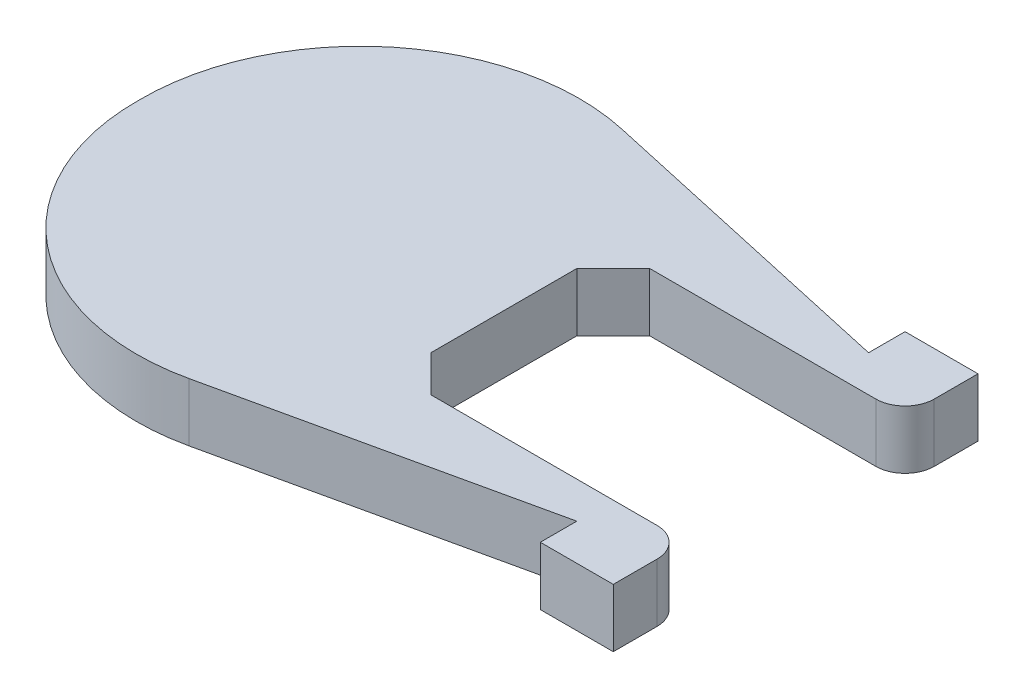
ISO-10303-21;
HEADER;
FILE_DESCRIPTION(('STEP AP214'),'2;1');
FILE_NAME('part.step','',(''),(''),'','','');
FILE_SCHEMA(('AUTOMOTIVE_DESIGN { 1 0 10303 214 1 1 1 1 }'));
ENDSEC;
DATA;
#1=APPLICATION_CONTEXT('core data for automotive mechanical design processes');
#2=APPLICATION_PROTOCOL_DEFINITION('international standard','automotive_design',2000,#1);
#3=PRODUCT_CONTEXT('',#1,'mechanical');
#4=PRODUCT('Part','Part','',(#3));
#5=PRODUCT_RELATED_PRODUCT_CATEGORY('part','',(#4));
#6=PRODUCT_DEFINITION_FORMATION('','',#4);
#7=PRODUCT_DEFINITION_CONTEXT('part definition',#1,'design');
#8=PRODUCT_DEFINITION('design','',#6,#7);
#9=PRODUCT_DEFINITION_SHAPE('','',#8);
#10=(LENGTH_UNIT() NAMED_UNIT(*) SI_UNIT(.MILLI.,.METRE.));
#11=(NAMED_UNIT(*) PLANE_ANGLE_UNIT() SI_UNIT($,.RADIAN.));
#12=(NAMED_UNIT(*) SI_UNIT($,.STERADIAN.) SOLID_ANGLE_UNIT());
#13=UNCERTAINTY_MEASURE_WITH_UNIT(LENGTH_MEASURE(1.E-05),#10,'distance_accuracy_value','');
#14=(GEOMETRIC_REPRESENTATION_CONTEXT(3) GLOBAL_UNCERTAINTY_ASSIGNED_CONTEXT((#13)) GLOBAL_UNIT_ASSIGNED_CONTEXT((#10,
#11,#12)) REPRESENTATION_CONTEXT('',''));
#15=CARTESIAN_POINT('',(0.,0.,0.));
#16=DIRECTION('',(0.,0.,1.));
#17=DIRECTION('',(1.,0.,0.));
#18=AXIS2_PLACEMENT_3D('',#15,#16,#17);
#19=CARTESIAN_POINT('',(40.,8.,-25.));
#20=DIRECTION('',(0.,0.,1.));
#21=DIRECTION('',(1.,0.,0.));
#22=AXIS2_PLACEMENT_3D('',#19,#20,#21);
#23=PLANE('',#22);
#24=DIRECTION('',(-1.,0.,0.));
#25=VECTOR('',#24,1.);
#26=CARTESIAN_POINT('',(40.,0.,-25.));
#27=LINE('',#26,#25);
#28=CARTESIAN_POINT('',(40.,0.,-25.));
#29=VERTEX_POINT('',#28);
#30=CARTESIAN_POINT('',(30.,0.,-25.));
#31=VERTEX_POINT('',#30);
#32=EDGE_CURVE('E185',#29,#31,#27,.T.);
#33=ORIENTED_EDGE('',*,*,#32,.T.);
#34=DIRECTION('',(0.,-1.,0.));
#35=VECTOR('',#34,1.);
#36=CARTESIAN_POINT('',(30.,8.,-25.));
#37=LINE('',#36,#35);
#38=CARTESIAN_POINT('',(30.,8.,-25.));
#39=VERTEX_POINT('',#38);
#40=EDGE_CURVE('E11',#39,#31,#37,.T.);
#41=ORIENTED_EDGE('',*,*,#40,.F.);
#42=DIRECTION('',(-1.,0.,0.));
#43=VECTOR('',#42,1.);
#44=CARTESIAN_POINT('',(40.,8.,-25.));
#45=LINE('',#44,#43);
#46=CARTESIAN_POINT('',(40.,8.,-25.));
#47=VERTEX_POINT('',#46);
#48=EDGE_CURVE('E217',#47,#39,#45,.T.);
#49=ORIENTED_EDGE('',*,*,#48,.F.);
#50=DIRECTION('',(0.,-1.,0.));
#51=VECTOR('',#50,1.);
#52=CARTESIAN_POINT('',(40.,8.,-25.));
#53=LINE('',#52,#51);
#54=EDGE_CURVE('E181',#47,#29,#53,.T.);
#55=ORIENTED_EDGE('',*,*,#54,.T.);
#56=EDGE_LOOP('',(#33,#41,#49,#55));
#57=FACE_BOUND('',#56,.T.);
#58=ADVANCED_FACE('F35',(#57),#23,.F.);
#59=CARTESIAN_POINT('',(30.,8.,-25.));
#60=DIRECTION('',(1.,0.,0.));
#61=DIRECTION('',(0.,0.,-1.));
#62=AXIS2_PLACEMENT_3D('',#59,#60,#61);
#63=PLANE('',#62);
#64=DIRECTION('',(0.,0.,1.));
#65=VECTOR('',#64,1.);
#66=CARTESIAN_POINT('',(30.,0.,-25.));
#67=LINE('',#66,#65);
#68=CARTESIAN_POINT('',(30.,0.,-20.));
#69=VERTEX_POINT('',#68);
#70=EDGE_CURVE('E188',#31,#69,#67,.T.);
#71=ORIENTED_EDGE('',*,*,#70,.T.);
#72=DIRECTION('',(0.,-1.,0.));
#73=VECTOR('',#72,1.);
#74=CARTESIAN_POINT('',(30.,8.,-20.));
#75=LINE('',#74,#73);
#76=CARTESIAN_POINT('',(30.,8.,-20.));
#77=VERTEX_POINT('',#76);
#78=EDGE_CURVE('E43',#77,#69,#75,.T.);
#79=ORIENTED_EDGE('',*,*,#78,.F.);
#80=DIRECTION('',(0.,0.,1.));
#81=VECTOR('',#80,1.);
#82=CARTESIAN_POINT('',(30.,8.,-25.));
#83=LINE('',#82,#81);
#84=EDGE_CURVE('E121',#39,#77,#83,.T.);
#85=ORIENTED_EDGE('',*,*,#84,.F.);
#86=ORIENTED_EDGE('',*,*,#40,.T.);
#87=EDGE_LOOP('',(#71,#79,#85,#86));
#88=FACE_BOUND('',#87,.T.);
#89=ADVANCED_FACE('F320',(#88),#63,.F.);
#90=CARTESIAN_POINT('',(30.,8.,-20.));
#91=DIRECTION('',(-0.216439613938103,0.,0.976296007119933));
#92=DIRECTION('',(0.976296007119933,0.,0.216439613938103));
#93=AXIS2_PLACEMENT_3D('',#90,#91,#92);
#94=PLANE('',#93);
#95=DIRECTION('',(-0.976296007119933,0.,-0.216439613938103));
#96=VECTOR('',#95,1.);
#97=CARTESIAN_POINT('',(30.,0.,-20.));
#98=LINE('',#97,#96);
#99=CARTESIAN_POINT('',(-13.5068115818569,0.,-29.6452279163097));
#100=VERTEX_POINT('',#99);
#101=EDGE_CURVE('E190',#69,#100,#98,.T.);
#102=ORIENTED_EDGE('',*,*,#101,.T.);
#103=DIRECTION('',(0.,-1.,0.));
#104=VECTOR('',#103,1.);
#105=CARTESIAN_POINT('',(-13.5068115818569,8.,-29.6452279163097));
#106=LINE('',#105,#104);
#107=CARTESIAN_POINT('',(-13.5068115818569,8.,-29.6452279163097));
#108=VERTEX_POINT('',#107);
#109=EDGE_CURVE('E251',#108,#100,#106,.T.);
#110=ORIENTED_EDGE('',*,*,#109,.F.);
#111=DIRECTION('',(-0.976296007119933,0.,-0.216439613938103));
#112=VECTOR('',#111,1.);
#113=CARTESIAN_POINT('',(30.,8.,-20.));
#114=LINE('',#113,#112);
#115=EDGE_CURVE('E259',#77,#108,#114,.T.);
#116=ORIENTED_EDGE('',*,*,#115,.F.);
#117=ORIENTED_EDGE('',*,*,#78,.T.);
#118=EDGE_LOOP('',(#102,#110,#116,#117));
#119=FACE_BOUND('',#118,.T.);
#120=ADVANCED_FACE('F257',(#119),#94,.F.);
#121=CARTESIAN_POINT('',(-20.,8.,-0.356347702711738));
#122=DIRECTION('',(0.,-1.,0.));
#123=DIRECTION('',(0.,0.,-1.));
#124=AXIS2_PLACEMENT_3D('',#121,#122,#123);
#125=CYLINDRICAL_SURFACE('',#124,30.);
#126=CARTESIAN_POINT('',(-20.,0.,-0.356347702711738));
#127=DIRECTION('',(0.,1.,0.));
#128=DIRECTION('',(0.,0.,1.));
#129=AXIS2_PLACEMENT_3D('',#126,#127,#128);
#130=CIRCLE('',#129,30.);
#131=CARTESIAN_POINT('',(-49.9978835305888,0.,0.));
#132=VERTEX_POINT('',#131);
#133=EDGE_CURVE('E192',#100,#132,#130,.T.);
#134=ORIENTED_EDGE('',*,*,#133,.T.);
#135=DIRECTION('',(0.,-1.,0.));
#136=VECTOR('',#135,1.);
#137=CARTESIAN_POINT('',(-49.9978835305888,8.,0.));
#138=LINE('',#137,#136);
#139=CARTESIAN_POINT('',(-49.9978835305888,8.,0.));
#140=VERTEX_POINT('',#139);
#141=EDGE_CURVE('E248',#140,#132,#138,.T.);
#142=ORIENTED_EDGE('',*,*,#141,.F.);
#143=CARTESIAN_POINT('',(-20.,8.,-0.356347702711738));
#144=DIRECTION('',(0.,1.,0.));
#145=DIRECTION('',(0.,0.,1.));
#146=AXIS2_PLACEMENT_3D('',#143,#144,#145);
#147=CIRCLE('',#146,30.);
#148=EDGE_CURVE('E277',#108,#140,#147,.T.);
#149=ORIENTED_EDGE('',*,*,#148,.F.);
#150=ORIENTED_EDGE('',*,*,#109,.T.);
#151=EDGE_LOOP('',(#134,#142,#149,#150));
#152=FACE_BOUND('',#151,.T.);
#153=ADVANCED_FACE('F268',(#152),#125,.T.);
#154=CARTESIAN_POINT('',(-20.,8.,0.356347702711738));
#155=DIRECTION('',(0.,-1.,0.));
#156=DIRECTION('',(0.,0.,-1.));
#157=AXIS2_PLACEMENT_3D('',#154,#155,#156);
#158=CYLINDRICAL_SURFACE('',#157,30.);
#159=CARTESIAN_POINT('',(-20.,0.,0.356347702711738));
#160=DIRECTION('',(0.,1.,0.));
#161=DIRECTION('',(0.,0.,-1.));
#162=AXIS2_PLACEMENT_3D('',#159,#160,#161);
#163=CIRCLE('',#162,30.);
#164=CARTESIAN_POINT('',(-13.5068115818569,0.,29.6452279163097));
#165=VERTEX_POINT('',#164);
#166=EDGE_CURVE('E194',#132,#165,#163,.T.);
#167=ORIENTED_EDGE('',*,*,#166,.T.);
#168=DIRECTION('',(0.,-1.,0.));
#169=VECTOR('',#168,1.);
#170=CARTESIAN_POINT('',(-13.5068115818569,8.,29.6452279163097));
#171=LINE('',#170,#169);
#172=CARTESIAN_POINT('',(-13.5068115818569,8.,29.6452279163097));
#173=VERTEX_POINT('',#172);
#174=EDGE_CURVE('E245',#173,#165,#171,.T.);
#175=ORIENTED_EDGE('',*,*,#174,.F.);
#176=CARTESIAN_POINT('',(-20.,8.,0.356347702711738));
#177=DIRECTION('',(0.,1.,0.));
#178=DIRECTION('',(0.,0.,-1.));
#179=AXIS2_PLACEMENT_3D('',#176,#177,#178);
#180=CIRCLE('',#179,30.);
#181=EDGE_CURVE('E274',#140,#173,#180,.T.);
#182=ORIENTED_EDGE('',*,*,#181,.F.);
#183=ORIENTED_EDGE('',*,*,#141,.T.);
#184=EDGE_LOOP('',(#167,#175,#182,#183));
#185=FACE_BOUND('',#184,.T.);
#186=ADVANCED_FACE('F272',(#185),#158,.T.);
#187=CARTESIAN_POINT('',(30.,8.,20.));
#188=DIRECTION('',(-0.216439613938103,0.,-0.976296007119933));
#189=DIRECTION('',(-0.976296007119933,0.,0.216439613938103));
#190=AXIS2_PLACEMENT_3D('',#187,#188,#189);
#191=PLANE('',#190);
#192=DIRECTION('',(0.976296007119933,0.,-0.216439613938103));
#193=VECTOR('',#192,1.);
#194=CARTESIAN_POINT('',(30.,0.,20.));
#195=LINE('',#194,#193);
#196=CARTESIAN_POINT('',(30.,0.,20.));
#197=VERTEX_POINT('',#196);
#198=EDGE_CURVE('E196',#165,#197,#195,.T.);
#199=ORIENTED_EDGE('',*,*,#198,.T.);
#200=DIRECTION('',(0.,-1.,0.));
#201=VECTOR('',#200,1.);
#202=CARTESIAN_POINT('',(30.,8.,20.));
#203=LINE('',#202,#201);
#204=CARTESIAN_POINT('',(30.,8.,20.));
#205=VERTEX_POINT('',#204);
#206=EDGE_CURVE('E242',#205,#197,#203,.T.);
#207=ORIENTED_EDGE('',*,*,#206,.F.);
#208=DIRECTION('',(0.976296007119933,0.,-0.216439613938103));
#209=VECTOR('',#208,1.);
#210=CARTESIAN_POINT('',(30.,8.,20.));
#211=LINE('',#210,#209);
#212=EDGE_CURVE('E276',#173,#205,#211,.T.);
#213=ORIENTED_EDGE('',*,*,#212,.F.);
#214=ORIENTED_EDGE('',*,*,#174,.T.);
#215=EDGE_LOOP('',(#199,#207,#213,#214));
#216=FACE_BOUND('',#215,.T.);
#217=ADVANCED_FACE('F333',(#216),#191,.F.);
#218=CARTESIAN_POINT('',(30.,8.,25.));
#219=DIRECTION('',(1.,0.,0.));
#220=DIRECTION('',(0.,0.,-1.));
#221=AXIS2_PLACEMENT_3D('',#218,#219,#220);
#222=PLANE('',#221);
#223=DIRECTION('',(0.,0.,1.));
#224=VECTOR('',#223,1.);
#225=CARTESIAN_POINT('',(30.,0.,25.));
#226=LINE('',#225,#224);
#227=CARTESIAN_POINT('',(30.,0.,25.));
#228=VERTEX_POINT('',#227);
#229=EDGE_CURVE('E198',#197,#228,#226,.T.);
#230=ORIENTED_EDGE('',*,*,#229,.T.);
#231=DIRECTION('',(0.,-1.,0.));
#232=VECTOR('',#231,1.);
#233=CARTESIAN_POINT('',(30.,8.,25.));
#234=LINE('',#233,#232);
#235=CARTESIAN_POINT('',(30.,8.,25.));
#236=VERTEX_POINT('',#235);
#237=EDGE_CURVE('E239',#236,#228,#234,.T.);
#238=ORIENTED_EDGE('',*,*,#237,.F.);
#239=DIRECTION('',(0.,0.,1.));
#240=VECTOR('',#239,1.);
#241=CARTESIAN_POINT('',(30.,8.,25.));
#242=LINE('',#241,#240);
#243=EDGE_CURVE('E279',#205,#236,#242,.T.);
#244=ORIENTED_EDGE('',*,*,#243,.F.);
#245=ORIENTED_EDGE('',*,*,#206,.T.);
#246=EDGE_LOOP('',(#230,#238,#244,#245));
#247=FACE_BOUND('',#246,.T.);
#248=ADVANCED_FACE('F336',(#247),#222,.F.);
#249=CARTESIAN_POINT('',(40.,8.,25.));
#250=DIRECTION('',(0.,0.,-1.));
#251=DIRECTION('',(-1.,0.,0.));
#252=AXIS2_PLACEMENT_3D('',#249,#250,#251);
#253=PLANE('',#252);
#254=DIRECTION('',(1.,0.,0.));
#255=VECTOR('',#254,1.);
#256=CARTESIAN_POINT('',(40.,0.,25.));
#257=LINE('',#256,#255);
#258=CARTESIAN_POINT('',(40.,0.,25.));
#259=VERTEX_POINT('',#258);
#260=EDGE_CURVE('E200',#228,#259,#257,.T.);
#261=ORIENTED_EDGE('',*,*,#260,.T.);
#262=DIRECTION('',(0.,-1.,0.));
#263=VECTOR('',#262,1.);
#264=CARTESIAN_POINT('',(40.,8.,25.));
#265=LINE('',#264,#263);
#266=CARTESIAN_POINT('',(40.,8.,25.));
#267=VERTEX_POINT('',#266);
#268=EDGE_CURVE('E236',#267,#259,#265,.T.);
#269=ORIENTED_EDGE('',*,*,#268,.F.);
#270=DIRECTION('',(1.,0.,0.));
#271=VECTOR('',#270,1.);
#272=CARTESIAN_POINT('',(40.,8.,25.));
#273=LINE('',#272,#271);
#274=EDGE_CURVE('E285',#236,#267,#273,.T.);
#275=ORIENTED_EDGE('',*,*,#274,.F.);
#276=ORIENTED_EDGE('',*,*,#237,.T.);
#277=EDGE_LOOP('',(#261,#269,#275,#276));
#278=FACE_BOUND('',#277,.T.);
#279=ADVANCED_FACE('F340',(#278),#253,.F.);
#280=CARTESIAN_POINT('',(40.,8.,19.));
#281=DIRECTION('',(-1.,0.,0.));
#282=DIRECTION('',(0.,0.,1.));
#283=AXIS2_PLACEMENT_3D('',#280,#281,#282);
#284=PLANE('',#283);
#285=DIRECTION('',(0.,0.,-1.));
#286=VECTOR('',#285,1.);
#287=CARTESIAN_POINT('',(40.,0.,19.));
#288=LINE('',#287,#286);
#289=CARTESIAN_POINT('',(40.,0.,19.));
#290=VERTEX_POINT('',#289);
#291=EDGE_CURVE('E202',#259,#290,#288,.T.);
#292=ORIENTED_EDGE('',*,*,#291,.T.);
#293=DIRECTION('',(0.,-1.,0.));
#294=VECTOR('',#293,1.);
#295=CARTESIAN_POINT('',(40.,8.,19.));
#296=LINE('',#295,#294);
#297=CARTESIAN_POINT('',(40.,8.,19.));
#298=VERTEX_POINT('',#297);
#299=EDGE_CURVE('E233',#298,#290,#296,.T.);
#300=ORIENTED_EDGE('',*,*,#299,.F.);
#301=DIRECTION('',(0.,0.,-1.));
#302=VECTOR('',#301,1.);
#303=CARTESIAN_POINT('',(40.,8.,19.));
#304=LINE('',#303,#302);
#305=EDGE_CURVE('E287',#267,#298,#304,.T.);
#306=ORIENTED_EDGE('',*,*,#305,.F.);
#307=ORIENTED_EDGE('',*,*,#268,.T.);
#308=EDGE_LOOP('',(#292,#300,#306,#307));
#309=FACE_BOUND('',#308,.T.);
#310=ADVANCED_FACE('F344',(#309),#284,.F.);
#311=CARTESIAN_POINT('',(36.,8.,19.));
#312=DIRECTION('',(0.,-1.,0.));
#313=DIRECTION('',(0.,0.,-1.));
#314=AXIS2_PLACEMENT_3D('',#311,#312,#313);
#315=CYLINDRICAL_SURFACE('',#314,4.);
#316=CARTESIAN_POINT('',(36.,0.,19.));
#317=DIRECTION('',(0.,1.,0.));
#318=DIRECTION('',(0.,0.,-1.));
#319=AXIS2_PLACEMENT_3D('',#316,#317,#318);
#320=CIRCLE('',#319,4.);
#321=CARTESIAN_POINT('',(36.,0.,15.));
#322=VERTEX_POINT('',#321);
#323=EDGE_CURVE('E204',#290,#322,#320,.T.);
#324=ORIENTED_EDGE('',*,*,#323,.T.);
#325=DIRECTION('',(0.,-1.,0.));
#326=VECTOR('',#325,1.);
#327=CARTESIAN_POINT('',(36.,8.,15.));
#328=LINE('',#327,#326);
#329=CARTESIAN_POINT('',(36.,8.,15.));
#330=VERTEX_POINT('',#329);
#331=EDGE_CURVE('E230',#330,#322,#328,.T.);
#332=ORIENTED_EDGE('',*,*,#331,.F.);
#333=CARTESIAN_POINT('',(36.,8.,19.));
#334=DIRECTION('',(0.,1.,0.));
#335=DIRECTION('',(0.,0.,-1.));
#336=AXIS2_PLACEMENT_3D('',#333,#334,#335);
#337=CIRCLE('',#336,4.);
#338=EDGE_CURVE('E289',#298,#330,#337,.T.);
#339=ORIENTED_EDGE('',*,*,#338,.F.);
#340=ORIENTED_EDGE('',*,*,#299,.T.);
#341=EDGE_LOOP('',(#324,#332,#339,#340));
#342=FACE_BOUND('',#341,.T.);
#343=ADVANCED_FACE('F348',(#342),#315,.T.);
#344=CARTESIAN_POINT('',(5.,8.,15.));
#345=DIRECTION('',(0.,0.,1.));
#346=DIRECTION('',(1.,0.,0.));
#347=AXIS2_PLACEMENT_3D('',#344,#345,#346);
#348=PLANE('',#347);
#349=DIRECTION('',(-1.,0.,0.));
#350=VECTOR('',#349,1.);
#351=CARTESIAN_POINT('',(5.,0.,15.));
#352=LINE('',#351,#350);
#353=CARTESIAN_POINT('',(5.,0.,15.));
#354=VERTEX_POINT('',#353);
#355=EDGE_CURVE('E206',#322,#354,#352,.T.);
#356=ORIENTED_EDGE('',*,*,#355,.T.);
#357=DIRECTION('',(0.,-1.,0.));
#358=VECTOR('',#357,1.);
#359=CARTESIAN_POINT('',(5.,8.,15.));
#360=LINE('',#359,#358);
#361=CARTESIAN_POINT('',(5.,8.,15.));
#362=VERTEX_POINT('',#361);
#363=EDGE_CURVE('E227',#362,#354,#360,.T.);
#364=ORIENTED_EDGE('',*,*,#363,.F.);
#365=DIRECTION('',(-1.,0.,0.));
#366=VECTOR('',#365,1.);
#367=CARTESIAN_POINT('',(5.,8.,15.));
#368=LINE('',#367,#366);
#369=EDGE_CURVE('E291',#330,#362,#368,.T.);
#370=ORIENTED_EDGE('',*,*,#369,.F.);
#371=ORIENTED_EDGE('',*,*,#331,.T.);
#372=EDGE_LOOP('',(#356,#364,#370,#371));
#373=FACE_BOUND('',#372,.T.);
#374=ADVANCED_FACE('F352',(#373),#348,.F.);
#375=CARTESIAN_POINT('',(0.,8.,9.99999999999999));
#376=DIRECTION('',(-0.707106781186548,0.,0.707106781186547));
#377=DIRECTION('',(0.707106781186547,0.,0.707106781186548));
#378=AXIS2_PLACEMENT_3D('',#375,#376,#377);
#379=PLANE('',#378);
#380=DIRECTION('',(-0.707106781186547,0.,-0.707106781186548));
#381=VECTOR('',#380,1.);
#382=CARTESIAN_POINT('',(0.,0.,9.99999999999999));
#383=LINE('',#382,#381);
#384=CARTESIAN_POINT('',(0.,0.,9.99999999999999));
#385=VERTEX_POINT('',#384);
#386=EDGE_CURVE('E208',#354,#385,#383,.T.);
#387=ORIENTED_EDGE('',*,*,#386,.T.);
#388=DIRECTION('',(0.,-1.,0.));
#389=VECTOR('',#388,1.);
#390=CARTESIAN_POINT('',(0.,8.,9.99999999999999));
#391=LINE('',#390,#389);
#392=CARTESIAN_POINT('',(0.,8.,9.99999999999999));
#393=VERTEX_POINT('',#392);
#394=EDGE_CURVE('E224',#393,#385,#391,.T.);
#395=ORIENTED_EDGE('',*,*,#394,.F.);
#396=DIRECTION('',(-0.707106781186547,0.,-0.707106781186548));
#397=VECTOR('',#396,1.);
#398=CARTESIAN_POINT('',(0.,8.,9.99999999999999));
#399=LINE('',#398,#397);
#400=EDGE_CURVE('E293',#362,#393,#399,.T.);
#401=ORIENTED_EDGE('',*,*,#400,.F.);
#402=ORIENTED_EDGE('',*,*,#363,.T.);
#403=EDGE_LOOP('',(#387,#395,#401,#402));
#404=FACE_BOUND('',#403,.T.);
#405=ADVANCED_FACE('F356',(#404),#379,.F.);
#406=CARTESIAN_POINT('',(0.,8.,9.99999999999999));
#407=DIRECTION('',(-1.,0.,0.));
#408=DIRECTION('',(0.,0.,1.));
#409=AXIS2_PLACEMENT_3D('',#406,#407,#408);
#410=PLANE('',#409);
#411=DIRECTION('',(0.,0.,-1.));
#412=VECTOR('',#411,1.);
#413=CARTESIAN_POINT('',(0.,0.,9.99999999999999));
#414=LINE('',#413,#412);
#415=CARTESIAN_POINT('',(0.,0.,-9.99999999999999));
#416=VERTEX_POINT('',#415);
#417=EDGE_CURVE('E210',#385,#416,#414,.T.);
#418=ORIENTED_EDGE('',*,*,#417,.T.);
#419=DIRECTION('',(0.,-1.,0.));
#420=VECTOR('',#419,1.);
#421=CARTESIAN_POINT('',(0.,8.,-9.99999999999999));
#422=LINE('',#421,#420);
#423=CARTESIAN_POINT('',(0.,8.,-9.99999999999999));
#424=VERTEX_POINT('',#423);
#425=EDGE_CURVE('E221',#424,#416,#422,.T.);
#426=ORIENTED_EDGE('',*,*,#425,.F.);
#427=DIRECTION('',(0.,0.,-1.));
#428=VECTOR('',#427,1.);
#429=CARTESIAN_POINT('',(0.,8.,9.99999999999999));
#430=LINE('',#429,#428);
#431=EDGE_CURVE('E295',#393,#424,#430,.T.);
#432=ORIENTED_EDGE('',*,*,#431,.F.);
#433=ORIENTED_EDGE('',*,*,#394,.T.);
#434=EDGE_LOOP('',(#418,#426,#432,#433));
#435=FACE_BOUND('',#434,.T.);
#436=ADVANCED_FACE('F301',(#435),#410,.F.);
#437=CARTESIAN_POINT('',(0.,8.,-9.99999999999999));
#438=DIRECTION('',(-0.707106781186548,0.,-0.707106781186547));
#439=DIRECTION('',(-0.707106781186547,0.,0.707106781186548));
#440=AXIS2_PLACEMENT_3D('',#437,#438,#439);
#441=PLANE('',#440);
#442=DIRECTION('',(0.707106781186547,0.,-0.707106781186548));
#443=VECTOR('',#442,1.);
#444=CARTESIAN_POINT('',(0.,0.,-9.99999999999999));
#445=LINE('',#444,#443);
#446=CARTESIAN_POINT('',(5.,0.,-15.));
#447=VERTEX_POINT('',#446);
#448=EDGE_CURVE('E212',#416,#447,#445,.T.);
#449=ORIENTED_EDGE('',*,*,#448,.T.);
#450=DIRECTION('',(0.,-1.,0.));
#451=VECTOR('',#450,1.);
#452=CARTESIAN_POINT('',(5.,8.,-15.));
#453=LINE('',#452,#451);
#454=CARTESIAN_POINT('',(5.,8.,-15.));
#455=VERTEX_POINT('',#454);
#456=EDGE_CURVE('E176',#455,#447,#453,.T.);
#457=ORIENTED_EDGE('',*,*,#456,.F.);
#458=DIRECTION('',(0.707106781186547,0.,-0.707106781186548));
#459=VECTOR('',#458,1.);
#460=CARTESIAN_POINT('',(0.,8.,-9.99999999999999));
#461=LINE('',#460,#459);
#462=EDGE_CURVE('E167',#424,#455,#461,.T.);
#463=ORIENTED_EDGE('',*,*,#462,.F.);
#464=ORIENTED_EDGE('',*,*,#425,.T.);
#465=EDGE_LOOP('',(#449,#457,#463,#464));
#466=FACE_BOUND('',#465,.T.);
#467=ADVANCED_FACE('F305',(#466),#441,.F.);
#468=CARTESIAN_POINT('',(5.,8.,-15.));
#469=DIRECTION('',(0.,0.,-1.));
#470=DIRECTION('',(-1.,0.,0.));
#471=AXIS2_PLACEMENT_3D('',#468,#469,#470);
#472=PLANE('',#471);
#473=DIRECTION('',(1.,0.,0.));
#474=VECTOR('',#473,1.);
#475=CARTESIAN_POINT('',(5.,0.,-15.));
#476=LINE('',#475,#474);
#477=CARTESIAN_POINT('',(36.,0.,-15.));
#478=VERTEX_POINT('',#477);
#479=EDGE_CURVE('E175',#447,#478,#476,.T.);
#480=ORIENTED_EDGE('',*,*,#479,.T.);
#481=DIRECTION('',(0.,-1.,0.));
#482=VECTOR('',#481,1.);
#483=CARTESIAN_POINT('',(36.,8.,-15.));
#484=LINE('',#483,#482);
#485=CARTESIAN_POINT('',(36.,8.,-15.));
#486=VERTEX_POINT('',#485);
#487=EDGE_CURVE('E172',#486,#478,#484,.T.);
#488=ORIENTED_EDGE('',*,*,#487,.F.);
#489=DIRECTION('',(1.,0.,0.));
#490=VECTOR('',#489,1.);
#491=CARTESIAN_POINT('',(5.,8.,-15.));
#492=LINE('',#491,#490);
#493=EDGE_CURVE('E161',#455,#486,#492,.T.);
#494=ORIENTED_EDGE('',*,*,#493,.F.);
#495=ORIENTED_EDGE('',*,*,#456,.T.);
#496=EDGE_LOOP('',(#480,#488,#494,#495));
#497=FACE_BOUND('',#496,.T.);
#498=ADVANCED_FACE('F173',(#497),#472,.F.);
#499=CARTESIAN_POINT('',(36.,8.,-19.));
#500=DIRECTION('',(0.,-1.,0.));
#501=DIRECTION('',(0.,0.,-1.));
#502=AXIS2_PLACEMENT_3D('',#499,#500,#501);
#503=CYLINDRICAL_SURFACE('',#502,4.);
#504=CARTESIAN_POINT('',(36.,0.,-19.));
#505=DIRECTION('',(0.,1.,0.));
#506=DIRECTION('',(0.,0.,1.));
#507=AXIS2_PLACEMENT_3D('',#504,#505,#506);
#508=CIRCLE('',#507,4.);
#509=CARTESIAN_POINT('',(40.,0.,-19.));
#510=VERTEX_POINT('',#509);
#511=EDGE_CURVE('E107',#478,#510,#508,.T.);
#512=ORIENTED_EDGE('',*,*,#511,.T.);
#513=DIRECTION('',(0.,-1.,0.));
#514=VECTOR('',#513,1.);
#515=CARTESIAN_POINT('',(40.,8.,-19.));
#516=LINE('',#515,#514);
#517=CARTESIAN_POINT('',(40.,8.,-19.));
#518=VERTEX_POINT('',#517);
#519=EDGE_CURVE('E177',#518,#510,#516,.T.);
#520=ORIENTED_EDGE('',*,*,#519,.F.);
#521=CARTESIAN_POINT('',(36.,8.,-19.));
#522=DIRECTION('',(0.,1.,0.));
#523=DIRECTION('',(0.,0.,1.));
#524=AXIS2_PLACEMENT_3D('',#521,#522,#523);
#525=CIRCLE('',#524,4.);
#526=EDGE_CURVE('E165',#486,#518,#525,.T.);
#527=ORIENTED_EDGE('',*,*,#526,.F.);
#528=ORIENTED_EDGE('',*,*,#487,.T.);
#529=EDGE_LOOP('',(#512,#520,#527,#528));
#530=FACE_BOUND('',#529,.T.);
#531=ADVANCED_FACE('F179',(#530),#503,.T.);
#532=CARTESIAN_POINT('',(40.,8.,-19.));
#533=DIRECTION('',(-1.,0.,0.));
#534=DIRECTION('',(0.,0.,1.));
#535=AXIS2_PLACEMENT_3D('',#532,#533,#534);
#536=PLANE('',#535);
#537=DIRECTION('',(0.,0.,-1.));
#538=VECTOR('',#537,1.);
#539=CARTESIAN_POINT('',(40.,0.,-19.));
#540=LINE('',#539,#538);
#541=EDGE_CURVE('E113',#510,#29,#540,.T.);
#542=ORIENTED_EDGE('',*,*,#541,.T.);
#543=ORIENTED_EDGE('',*,*,#54,.F.);
#544=DIRECTION('',(0.,0.,-1.));
#545=VECTOR('',#544,1.);
#546=CARTESIAN_POINT('',(40.,8.,-19.));
#547=LINE('',#546,#545);
#548=EDGE_CURVE('E51',#518,#47,#547,.T.);
#549=ORIENTED_EDGE('',*,*,#548,.F.);
#550=ORIENTED_EDGE('',*,*,#519,.T.);
#551=EDGE_LOOP('',(#542,#543,#549,#550));
#552=FACE_BOUND('',#551,.T.);
#553=ADVANCED_FACE('F309',(#552),#536,.F.);
#554=CARTESIAN_POINT('',(-20.,8.,-0.356347702711738));
#555=DIRECTION('',(0.,1.,0.));
#556=DIRECTION('',(0.,0.,1.));
#557=AXIS2_PLACEMENT_3D('',#554,#555,#556);
#558=PLANE('',#557);
#559=ORIENTED_EDGE('',*,*,#48,.T.);
#560=ORIENTED_EDGE('',*,*,#84,.T.);
#561=ORIENTED_EDGE('',*,*,#115,.T.);
#562=ORIENTED_EDGE('',*,*,#148,.T.);
#563=ORIENTED_EDGE('',*,*,#181,.T.);
#564=ORIENTED_EDGE('',*,*,#212,.T.);
#565=ORIENTED_EDGE('',*,*,#243,.T.);
#566=ORIENTED_EDGE('',*,*,#274,.T.);
#567=ORIENTED_EDGE('',*,*,#305,.T.);
#568=ORIENTED_EDGE('',*,*,#338,.T.);
#569=ORIENTED_EDGE('',*,*,#369,.T.);
#570=ORIENTED_EDGE('',*,*,#400,.T.);
#571=ORIENTED_EDGE('',*,*,#431,.T.);
#572=ORIENTED_EDGE('',*,*,#462,.T.);
#573=ORIENTED_EDGE('',*,*,#493,.T.);
#574=ORIENTED_EDGE('',*,*,#526,.T.);
#575=ORIENTED_EDGE('',*,*,#548,.T.);
#576=EDGE_LOOP('',(#559,#560,#561,#562,#563,#564,#565,#566,#567,#568,#569,#570,#571,#572,#573,
#574,#575));
#577=FACE_BOUND('',#576,.T.);
#578=ADVANCED_FACE('F163',(#577),#558,.T.);
#579=CARTESIAN_POINT('',(-20.,0.,-0.356347702711738));
#580=DIRECTION('',(0.,1.,0.));
#581=DIRECTION('',(0.,0.,1.));
#582=AXIS2_PLACEMENT_3D('',#579,#580,#581);
#583=PLANE('',#582);
#584=ORIENTED_EDGE('',*,*,#32,.F.);
#585=ORIENTED_EDGE('',*,*,#541,.F.);
#586=ORIENTED_EDGE('',*,*,#511,.F.);
#587=ORIENTED_EDGE('',*,*,#479,.F.);
#588=ORIENTED_EDGE('',*,*,#448,.F.);
#589=ORIENTED_EDGE('',*,*,#417,.F.);
#590=ORIENTED_EDGE('',*,*,#386,.F.);
#591=ORIENTED_EDGE('',*,*,#355,.F.);
#592=ORIENTED_EDGE('',*,*,#323,.F.);
#593=ORIENTED_EDGE('',*,*,#291,.F.);
#594=ORIENTED_EDGE('',*,*,#260,.F.);
#595=ORIENTED_EDGE('',*,*,#229,.F.);
#596=ORIENTED_EDGE('',*,*,#198,.F.);
#597=ORIENTED_EDGE('',*,*,#166,.F.);
#598=ORIENTED_EDGE('',*,*,#133,.F.);
#599=ORIENTED_EDGE('',*,*,#101,.F.);
#600=ORIENTED_EDGE('',*,*,#70,.F.);
#601=EDGE_LOOP('',(#584,#585,#586,#587,#588,#589,#590,#591,#592,#593,#594,#595,#596,#597,#598,
#599,#600));
#602=FACE_BOUND('',#601,.T.);
#603=ADVANCED_FACE('F263',(#602),#583,.F.);
#604=CLOSED_SHELL('',(#58,#89,#120,#153,#186,#217,#248,#279,#310,#343,#374,#405,#436,#467,#498,
#531,#553,#578,#603));
#605=MANIFOLD_SOLID_BREP('B2',#604);
#606=ADVANCED_BREP_SHAPE_REPRESENTATION('',(#18,#605),#14);
#607=SHAPE_DEFINITION_REPRESENTATION(#9,#606);
ENDSEC;
END-ISO-10303-21;
